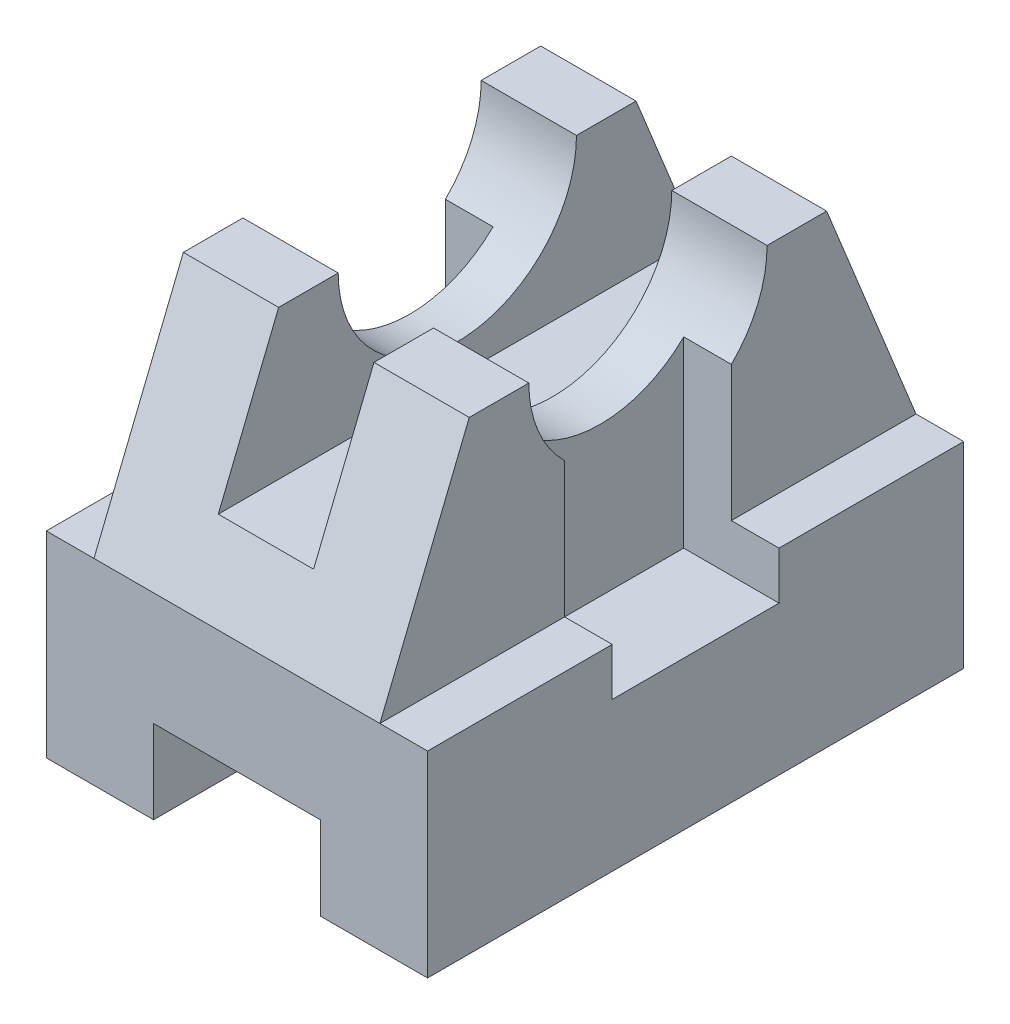
ISO-10303-21;
HEADER;
FILE_DESCRIPTION(('STEP AP214'),'2;1');
FILE_NAME('part.step','',(''),(''),'','','');
FILE_SCHEMA(('AUTOMOTIVE_DESIGN { 1 0 10303 214 1 1 1 1 }'));
ENDSEC;
DATA;
#1=APPLICATION_CONTEXT('core data for automotive mechanical design processes');
#2=APPLICATION_PROTOCOL_DEFINITION('international standard','automotive_design',2000,#1);
#3=PRODUCT_CONTEXT('',#1,'mechanical');
#4=PRODUCT('Part','Part','',(#3));
#5=PRODUCT_RELATED_PRODUCT_CATEGORY('part','',(#4));
#6=PRODUCT_DEFINITION_FORMATION('','',#4);
#7=PRODUCT_DEFINITION_CONTEXT('part definition',#1,'design');
#8=PRODUCT_DEFINITION('design','',#6,#7);
#9=PRODUCT_DEFINITION_SHAPE('','',#8);
#10=(LENGTH_UNIT() NAMED_UNIT(*) SI_UNIT(.MILLI.,.METRE.));
#11=(NAMED_UNIT(*) PLANE_ANGLE_UNIT() SI_UNIT($,.RADIAN.));
#12=(NAMED_UNIT(*) SI_UNIT($,.STERADIAN.) SOLID_ANGLE_UNIT());
#13=UNCERTAINTY_MEASURE_WITH_UNIT(LENGTH_MEASURE(1.E-05),#10,'distance_accuracy_value','');
#14=(GEOMETRIC_REPRESENTATION_CONTEXT(3) GLOBAL_UNCERTAINTY_ASSIGNED_CONTEXT((#13)) GLOBAL_UNIT_ASSIGNED_CONTEXT((#10,
#11,#12)) REPRESENTATION_CONTEXT('',''));
#15=CARTESIAN_POINT('',(0.,0.,0.));
#16=DIRECTION('',(0.,0.,1.));
#17=DIRECTION('',(1.,0.,0.));
#18=AXIS2_PLACEMENT_3D('',#15,#16,#17);
#19=CARTESIAN_POINT('',(0.,0.,0.));
#20=DIRECTION('',(0.,1.,0.));
#21=DIRECTION('',(0.,0.,1.));
#22=AXIS2_PLACEMENT_3D('',#19,#20,#21);
#23=PLANE('',#22);
#24=DIRECTION('',(-1.,0.,0.));
#25=VECTOR('',#24,1.);
#26=CARTESIAN_POINT('',(-32.,0.,-45.));
#27=LINE('',#26,#25);
#28=CARTESIAN_POINT('',(-14.,0.,-45.));
#29=VERTEX_POINT('',#28);
#30=CARTESIAN_POINT('',(-32.,0.,-45.));
#31=VERTEX_POINT('',#30);
#32=EDGE_CURVE('E263',#29,#31,#27,.T.);
#33=ORIENTED_EDGE('',*,*,#32,.F.);
#34=DIRECTION('',(0.,0.,1.));
#35=VECTOR('',#34,1.);
#36=CARTESIAN_POINT('',(-14.,0.,-45.));
#37=LINE('',#36,#35);
#38=CARTESIAN_POINT('',(-14.,0.,45.));
#39=VERTEX_POINT('',#38);
#40=EDGE_CURVE('E246',#29,#39,#37,.T.);
#41=ORIENTED_EDGE('',*,*,#40,.T.);
#42=DIRECTION('',(1.,0.,0.));
#43=VECTOR('',#42,1.);
#44=CARTESIAN_POINT('',(-32.,0.,45.));
#45=LINE('',#44,#43);
#46=CARTESIAN_POINT('',(-32.,0.,45.));
#47=VERTEX_POINT('',#46);
#48=EDGE_CURVE('E281',#47,#39,#45,.T.);
#49=ORIENTED_EDGE('',*,*,#48,.F.);
#50=DIRECTION('',(0.,0.,1.));
#51=VECTOR('',#50,1.);
#52=CARTESIAN_POINT('',(-32.,0.,-45.));
#53=LINE('',#52,#51);
#54=EDGE_CURVE('E269',#31,#47,#53,.T.);
#55=ORIENTED_EDGE('',*,*,#54,.F.);
#56=EDGE_LOOP('',(#33,#41,#49,#55));
#57=FACE_BOUND('',#56,.T.);
#58=ADVANCED_FACE('F37',(#57),#23,.F.);
#59=CARTESIAN_POINT('',(0.,33.,0.));
#60=DIRECTION('',(0.,1.,0.));
#61=DIRECTION('',(0.,0.,1.));
#62=AXIS2_PLACEMENT_3D('',#59,#60,#61);
#63=PLANE('',#62);
#64=DIRECTION('',(-1.,0.,0.));
#65=VECTOR('',#64,1.);
#66=CARTESIAN_POINT('',(0.,33.,-14.));
#67=LINE('',#66,#65);
#68=CARTESIAN_POINT('',(-24.,33.,-14.));
#69=VERTEX_POINT('',#68);
#70=CARTESIAN_POINT('',(-32.,33.,-14.));
#71=VERTEX_POINT('',#70);
#72=EDGE_CURVE('E350',#69,#71,#67,.T.);
#73=ORIENTED_EDGE('',*,*,#72,.F.);
#74=DIRECTION('',(0.,0.,-1.));
#75=VECTOR('',#74,1.);
#76=CARTESIAN_POINT('',(-24.,33.,-45.));
#77=LINE('',#76,#75);
#78=CARTESIAN_POINT('',(-24.,33.,-45.));
#79=VERTEX_POINT('',#78);
#80=EDGE_CURVE('E421',#69,#79,#77,.T.);
#81=ORIENTED_EDGE('',*,*,#80,.T.);
#82=DIRECTION('',(-1.,0.,0.));
#83=VECTOR('',#82,1.);
#84=CARTESIAN_POINT('',(-32.,33.,-45.));
#85=LINE('',#84,#83);
#86=CARTESIAN_POINT('',(-32.,33.,-45.));
#87=VERTEX_POINT('',#86);
#88=EDGE_CURVE('E446',#79,#87,#85,.T.);
#89=ORIENTED_EDGE('',*,*,#88,.T.);
#90=DIRECTION('',(0.,0.,1.));
#91=VECTOR('',#90,1.);
#92=CARTESIAN_POINT('',(-32.,33.,-45.));
#93=LINE('',#92,#91);
#94=EDGE_CURVE('E451',#87,#71,#93,.T.);
#95=ORIENTED_EDGE('',*,*,#94,.T.);
#96=EDGE_LOOP('',(#73,#81,#89,#95));
#97=FACE_BOUND('',#96,.T.);
#98=ADVANCED_FACE('F573',(#97),#63,.T.);
#99=DIRECTION('',(1.,0.,0.));
#100=VECTOR('',#99,1.);
#101=CARTESIAN_POINT('',(0.,33.,14.));
#102=LINE('',#101,#100);
#103=CARTESIAN_POINT('',(24.,33.,14.));
#104=VERTEX_POINT('',#103);
#105=CARTESIAN_POINT('',(32.,33.,14.));
#106=VERTEX_POINT('',#105);
#107=EDGE_CURVE('E356',#104,#106,#102,.T.);
#108=ORIENTED_EDGE('',*,*,#107,.F.);
#109=DIRECTION('',(0.,0.,-1.));
#110=VECTOR('',#109,1.);
#111=CARTESIAN_POINT('',(24.,33.,-45.));
#112=LINE('',#111,#110);
#113=CARTESIAN_POINT('',(24.,33.,45.));
#114=VERTEX_POINT('',#113);
#115=EDGE_CURVE('E403',#114,#104,#112,.T.);
#116=ORIENTED_EDGE('',*,*,#115,.F.);
#117=DIRECTION('',(1.,0.,0.));
#118=VECTOR('',#117,1.);
#119=CARTESIAN_POINT('',(-32.,33.,45.));
#120=LINE('',#119,#118);
#121=CARTESIAN_POINT('',(32.,33.,45.));
#122=VERTEX_POINT('',#121);
#123=EDGE_CURVE('E453',#114,#122,#120,.T.);
#124=ORIENTED_EDGE('',*,*,#123,.T.);
#125=DIRECTION('',(0.,0.,-1.));
#126=VECTOR('',#125,1.);
#127=CARTESIAN_POINT('',(32.,33.,-45.));
#128=LINE('',#127,#126);
#129=EDGE_CURVE('E443',#122,#106,#128,.T.);
#130=ORIENTED_EDGE('',*,*,#129,.T.);
#131=EDGE_LOOP('',(#108,#116,#124,#130));
#132=FACE_BOUND('',#131,.T.);
#133=ADVANCED_FACE('F461',(#132),#63,.T.);
#134=CARTESIAN_POINT('',(24.,70.,0.));
#135=DIRECTION('',(1.,0.,0.));
#136=DIRECTION('',(0.,0.,-1.));
#137=AXIS2_PLACEMENT_3D('',#134,#135,#136);
#138=PLANE('',#137);
#139=DIRECTION('',(0.,-1.,0.));
#140=VECTOR('',#139,1.);
#141=CARTESIAN_POINT('',(24.,70.,14.));
#142=LINE('',#141,#140);
#143=CARTESIAN_POINT('',(24.,55.7171431429143,14.));
#144=VERTEX_POINT('',#143);
#145=EDGE_CURVE('E312',#144,#104,#142,.T.);
#146=ORIENTED_EDGE('',*,*,#145,.F.);
#147=CARTESIAN_POINT('',(24.,70.,0.));
#148=DIRECTION('',(-1.,0.,0.));
#149=DIRECTION('',(0.,0.,-1.));
#150=AXIS2_PLACEMENT_3D('',#147,#148,#149);
#151=CIRCLE('',#150,20.);
#152=CARTESIAN_POINT('',(24.,70.,20.));
#153=VERTEX_POINT('',#152);
#154=EDGE_CURVE('E393',#144,#153,#151,.T.);
#155=ORIENTED_EDGE('',*,*,#154,.T.);
#156=DIRECTION('',(0.,0.,1.));
#157=VECTOR('',#156,1.);
#158=CARTESIAN_POINT('',(24.,70.,30.));
#159=LINE('',#158,#157);
#160=CARTESIAN_POINT('',(24.,70.,30.));
#161=VERTEX_POINT('',#160);
#162=EDGE_CURVE('E397',#153,#161,#159,.T.);
#163=ORIENTED_EDGE('',*,*,#162,.T.);
#164=DIRECTION('',(0.,-0.926739268223405,0.375705108739218));
#165=VECTOR('',#164,1.);
#166=CARTESIAN_POINT('',(24.,33.,45.));
#167=LINE('',#166,#165);
#168=EDGE_CURVE('E399',#161,#114,#167,.T.);
#169=ORIENTED_EDGE('',*,*,#168,.T.);
#170=ORIENTED_EDGE('',*,*,#115,.T.);
#171=EDGE_LOOP('',(#146,#155,#163,#169,#170));
#172=FACE_BOUND('',#171,.T.);
#173=ADVANCED_FACE('F619',(#172),#138,.T.);
#174=CARTESIAN_POINT('',(-24.,70.,0.));
#175=DIRECTION('',(1.,0.,0.));
#176=DIRECTION('',(0.,0.,-1.));
#177=AXIS2_PLACEMENT_3D('',#174,#175,#176);
#178=PLANE('',#177);
#179=ORIENTED_EDGE('',*,*,#80,.F.);
#180=DIRECTION('',(0.,1.,0.));
#181=VECTOR('',#180,1.);
#182=CARTESIAN_POINT('',(-24.,70.,-14.));
#183=LINE('',#182,#181);
#184=CARTESIAN_POINT('',(-24.,55.7171431429143,-14.));
#185=VERTEX_POINT('',#184);
#186=EDGE_CURVE('E307',#69,#185,#183,.T.);
#187=ORIENTED_EDGE('',*,*,#186,.T.);
#188=CARTESIAN_POINT('',(-24.,70.,0.));
#189=DIRECTION('',(-1.,0.,0.));
#190=DIRECTION('',(0.,0.,-1.));
#191=AXIS2_PLACEMENT_3D('',#188,#189,#190);
#192=CIRCLE('',#191,20.);
#193=CARTESIAN_POINT('',(-24.,70.,-20.));
#194=VERTEX_POINT('',#193);
#195=EDGE_CURVE('E413',#194,#185,#192,.T.);
#196=ORIENTED_EDGE('',*,*,#195,.F.);
#197=DIRECTION('',(0.,0.,1.));
#198=VECTOR('',#197,1.);
#199=CARTESIAN_POINT('',(-24.,70.,-20.));
#200=LINE('',#199,#198);
#201=CARTESIAN_POINT('',(-24.,70.,-30.));
#202=VERTEX_POINT('',#201);
#203=EDGE_CURVE('E409',#202,#194,#200,.T.);
#204=ORIENTED_EDGE('',*,*,#203,.F.);
#205=DIRECTION('',(0.,0.926739268223405,0.375705108739218));
#206=VECTOR('',#205,1.);
#207=CARTESIAN_POINT('',(-24.,70.,-30.));
#208=LINE('',#207,#206);
#209=EDGE_CURVE('E386',#79,#202,#208,.T.);
#210=ORIENTED_EDGE('',*,*,#209,.F.);
#211=EDGE_LOOP('',(#179,#187,#196,#204,#210));
#212=FACE_BOUND('',#211,.T.);
#213=ADVANCED_FACE('F555',(#212),#178,.F.);
#214=CARTESIAN_POINT('',(24.,70.,-20.));
#215=DIRECTION('',(0.,-1.,0.));
#216=DIRECTION('',(0.,0.,-1.));
#217=AXIS2_PLACEMENT_3D('',#214,#215,#216);
#218=PLANE('',#217);
#219=DIRECTION('',(-1.,0.,0.));
#220=VECTOR('',#219,1.);
#221=CARTESIAN_POINT('',(24.,70.,-30.));
#222=LINE('',#221,#220);
#223=CARTESIAN_POINT('',(24.,70.,-30.));
#224=VERTEX_POINT('',#223);
#225=CARTESIAN_POINT('',(7.99999999999999,70.,-30.));
#226=VERTEX_POINT('',#225);
#227=EDGE_CURVE('E275',#224,#226,#222,.T.);
#228=ORIENTED_EDGE('',*,*,#227,.T.);
#229=DIRECTION('',(0.,0.,-1.));
#230=VECTOR('',#229,1.);
#231=CARTESIAN_POINT('',(7.99999999999999,70.,-46.2601882858404));
#232=LINE('',#231,#230);
#233=CARTESIAN_POINT('',(8.,70.,-20.));
#234=VERTEX_POINT('',#233);
#235=EDGE_CURVE('E361',#234,#226,#232,.T.);
#236=ORIENTED_EDGE('',*,*,#235,.F.);
#237=DIRECTION('',(-1.,0.,0.));
#238=VECTOR('',#237,1.);
#239=CARTESIAN_POINT('',(24.,70.,-20.));
#240=LINE('',#239,#238);
#241=CARTESIAN_POINT('',(24.,70.,-20.));
#242=VERTEX_POINT('',#241);
#243=EDGE_CURVE('E437',#242,#234,#240,.T.);
#244=ORIENTED_EDGE('',*,*,#243,.F.);
#245=DIRECTION('',(0.,0.,1.));
#246=VECTOR('',#245,1.);
#247=CARTESIAN_POINT('',(24.,70.,-20.));
#248=LINE('',#247,#246);
#249=EDGE_CURVE('E390',#224,#242,#248,.T.);
#250=ORIENTED_EDGE('',*,*,#249,.F.);
#251=EDGE_LOOP('',(#228,#236,#244,#250));
#252=FACE_BOUND('',#251,.T.);
#253=ADVANCED_FACE('F541',(#252),#218,.F.);
#254=CARTESIAN_POINT('',(24.,70.,0.));
#255=DIRECTION('',(-1.,0.,0.));
#256=DIRECTION('',(0.,0.,1.));
#257=AXIS2_PLACEMENT_3D('',#254,#255,#256);
#258=CYLINDRICAL_SURFACE('',#257,20.);
#259=ORIENTED_EDGE('',*,*,#154,.F.);
#260=DIRECTION('',(-1.,0.,0.));
#261=VECTOR('',#260,1.);
#262=CARTESIAN_POINT('',(24.,55.7171431429143,14.));
#263=LINE('',#262,#261);
#264=CARTESIAN_POINT('',(16.,55.7171431429143,14.));
#265=VERTEX_POINT('',#264);
#266=EDGE_CURVE('E358',#144,#265,#263,.T.);
#267=ORIENTED_EDGE('',*,*,#266,.T.);
#268=CARTESIAN_POINT('',(16.,70.,0.));
#269=DIRECTION('',(-1.,0.,0.));
#270=DIRECTION('',(0.,0.,1.));
#271=AXIS2_PLACEMENT_3D('',#268,#269,#270);
#272=CIRCLE('',#271,20.);
#273=CARTESIAN_POINT('',(16.,55.7171431429143,-14.));
#274=VERTEX_POINT('',#273);
#275=EDGE_CURVE('E11',#265,#274,#272,.F.);
#276=ORIENTED_EDGE('',*,*,#275,.T.);
#277=DIRECTION('',(-1.,0.,0.));
#278=VECTOR('',#277,1.);
#279=CARTESIAN_POINT('',(24.,55.7171431429143,-14.));
#280=LINE('',#279,#278);
#281=CARTESIAN_POINT('',(24.,55.7171431429143,-14.));
#282=VERTEX_POINT('',#281);
#283=EDGE_CURVE('E353',#274,#282,#280,.F.);
#284=ORIENTED_EDGE('',*,*,#283,.T.);
#285=EDGE_CURVE('E394',#242,#282,#151,.T.);
#286=ORIENTED_EDGE('',*,*,#285,.F.);
#287=ORIENTED_EDGE('',*,*,#243,.T.);
#288=CARTESIAN_POINT('',(8.,70.,0.));
#289=DIRECTION('',(1.,0.,0.));
#290=DIRECTION('',(0.,0.,-1.));
#291=AXIS2_PLACEMENT_3D('',#288,#289,#290);
#292=CIRCLE('',#291,20.);
#293=CARTESIAN_POINT('',(8.,70.,20.));
#294=VERTEX_POINT('',#293);
#295=EDGE_CURVE('E380',#234,#294,#292,.F.);
#296=ORIENTED_EDGE('',*,*,#295,.T.);
#297=DIRECTION('',(-1.,0.,0.));
#298=VECTOR('',#297,1.);
#299=CARTESIAN_POINT('',(24.,70.,20.));
#300=LINE('',#299,#298);
#301=EDGE_CURVE('E433',#153,#294,#300,.T.);
#302=ORIENTED_EDGE('',*,*,#301,.F.);
#303=EDGE_LOOP('',(#259,#267,#276,#284,#286,#287,#296,#302));
#304=FACE_BOUND('',#303,.T.);
#305=ADVANCED_FACE('F568',(#304),#258,.F.);
#306=CARTESIAN_POINT('',(24.,70.,30.));
#307=DIRECTION('',(0.,-1.,0.));
#308=DIRECTION('',(0.,0.,-1.));
#309=AXIS2_PLACEMENT_3D('',#306,#307,#308);
#310=PLANE('',#309);
#311=ORIENTED_EDGE('',*,*,#301,.T.);
#312=CARTESIAN_POINT('',(8.,70.,30.));
#313=VERTEX_POINT('',#312);
#314=EDGE_CURVE('E370',#313,#294,#232,.T.);
#315=ORIENTED_EDGE('',*,*,#314,.F.);
#316=DIRECTION('',(-1.,0.,0.));
#317=VECTOR('',#316,1.);
#318=CARTESIAN_POINT('',(24.,70.,30.));
#319=LINE('',#318,#317);
#320=EDGE_CURVE('E429',#161,#313,#319,.T.);
#321=ORIENTED_EDGE('',*,*,#320,.F.);
#322=ORIENTED_EDGE('',*,*,#162,.F.);
#323=EDGE_LOOP('',(#311,#315,#321,#322));
#324=FACE_BOUND('',#323,.T.);
#325=ADVANCED_FACE('F668',(#324),#310,.F.);
#326=DIRECTION('',(1.,0.,0.));
#327=VECTOR('',#326,1.);
#328=CARTESIAN_POINT('',(0.,33.,14.));
#329=LINE('',#328,#327);
#330=CARTESIAN_POINT('',(-32.,33.,14.));
#331=VERTEX_POINT('',#330);
#332=CARTESIAN_POINT('',(-24.,33.,14.));
#333=VERTEX_POINT('',#332);
#334=EDGE_CURVE('E346',#331,#333,#329,.T.);
#335=ORIENTED_EDGE('',*,*,#334,.F.);
#336=CARTESIAN_POINT('',(-32.,33.,45.));
#337=VERTEX_POINT('',#336);
#338=EDGE_CURVE('E450',#331,#337,#93,.T.);
#339=ORIENTED_EDGE('',*,*,#338,.T.);
#340=CARTESIAN_POINT('',(-24.,33.,45.));
#341=VERTEX_POINT('',#340);
#342=EDGE_CURVE('E288',#337,#341,#120,.T.);
#343=ORIENTED_EDGE('',*,*,#342,.T.);
#344=EDGE_CURVE('E391',#341,#333,#77,.T.);
#345=ORIENTED_EDGE('',*,*,#344,.T.);
#346=EDGE_LOOP('',(#335,#339,#343,#345));
#347=FACE_BOUND('',#346,.T.);
#348=ADVANCED_FACE('F509',(#347),#63,.T.);
#349=CARTESIAN_POINT('',(32.,33.,-45.));
#350=DIRECTION('',(-1.,0.,0.));
#351=DIRECTION('',(0.,0.,1.));
#352=AXIS2_PLACEMENT_3D('',#349,#350,#351);
#353=PLANE('',#352);
#354=DIRECTION('',(0.,0.,-1.));
#355=VECTOR('',#354,1.);
#356=CARTESIAN_POINT('',(32.,25.,-14.));
#357=LINE('',#356,#355);
#358=CARTESIAN_POINT('',(32.,25.,14.));
#359=VERTEX_POINT('',#358);
#360=CARTESIAN_POINT('',(32.,25.,-14.));
#361=VERTEX_POINT('',#360);
#362=EDGE_CURVE('E338',#359,#361,#357,.T.);
#363=ORIENTED_EDGE('',*,*,#362,.F.);
#364=DIRECTION('',(0.,1.,0.));
#365=VECTOR('',#364,1.);
#366=CARTESIAN_POINT('',(32.,25.,14.));
#367=LINE('',#366,#365);
#368=EDGE_CURVE('E347',#359,#106,#367,.T.);
#369=ORIENTED_EDGE('',*,*,#368,.T.);
#370=ORIENTED_EDGE('',*,*,#129,.F.);
#371=DIRECTION('',(0.,-1.,0.));
#372=VECTOR('',#371,1.);
#373=CARTESIAN_POINT('',(32.,33.,45.));
#374=LINE('',#373,#372);
#375=CARTESIAN_POINT('',(32.,0.,45.));
#376=VERTEX_POINT('',#375);
#377=EDGE_CURVE('E284',#122,#376,#374,.T.);
#378=ORIENTED_EDGE('',*,*,#377,.T.);
#379=DIRECTION('',(0.,0.,-1.));
#380=VECTOR('',#379,1.);
#381=CARTESIAN_POINT('',(32.,0.,-45.));
#382=LINE('',#381,#380);
#383=CARTESIAN_POINT('',(32.,0.,-45.));
#384=VERTEX_POINT('',#383);
#385=EDGE_CURVE('E271',#376,#384,#382,.T.);
#386=ORIENTED_EDGE('',*,*,#385,.T.);
#387=DIRECTION('',(0.,-1.,0.));
#388=VECTOR('',#387,1.);
#389=CARTESIAN_POINT('',(32.,33.,-45.));
#390=LINE('',#389,#388);
#391=CARTESIAN_POINT('',(32.,33.,-45.));
#392=VERTEX_POINT('',#391);
#393=EDGE_CURVE('E293',#392,#384,#390,.T.);
#394=ORIENTED_EDGE('',*,*,#393,.F.);
#395=CARTESIAN_POINT('',(32.,33.,-14.));
#396=VERTEX_POINT('',#395);
#397=EDGE_CURVE('E283',#396,#392,#128,.T.);
#398=ORIENTED_EDGE('',*,*,#397,.F.);
#399=DIRECTION('',(0.,1.,0.));
#400=VECTOR('',#399,1.);
#401=CARTESIAN_POINT('',(32.,25.,-14.));
#402=LINE('',#401,#400);
#403=EDGE_CURVE('E487',#361,#396,#402,.T.);
#404=ORIENTED_EDGE('',*,*,#403,.F.);
#405=EDGE_LOOP('',(#363,#369,#370,#378,#386,#394,#398,#404));
#406=FACE_BOUND('',#405,.T.);
#407=ADVANCED_FACE('F39',(#406),#353,.F.);
#408=CARTESIAN_POINT('',(-32.,33.,-45.));
#409=DIRECTION('',(0.,0.,1.));
#410=DIRECTION('',(1.,0.,0.));
#411=AXIS2_PLACEMENT_3D('',#408,#409,#410);
#412=PLANE('',#411);
#413=DIRECTION('',(-1.,0.,0.));
#414=VECTOR('',#413,1.);
#415=CARTESIAN_POINT('',(-14.,14.,-45.));
#416=LINE('',#415,#414);
#417=CARTESIAN_POINT('',(14.,14.,-45.));
#418=VERTEX_POINT('',#417);
#419=CARTESIAN_POINT('',(-14.,14.,-45.));
#420=VERTEX_POINT('',#419);
#421=EDGE_CURVE('E258',#418,#420,#416,.T.);
#422=ORIENTED_EDGE('',*,*,#421,.T.);
#423=DIRECTION('',(0.,-1.,0.));
#424=VECTOR('',#423,1.);
#425=CARTESIAN_POINT('',(-14.,0.,-45.));
#426=LINE('',#425,#424);
#427=EDGE_CURVE('E249',#420,#29,#426,.T.);
#428=ORIENTED_EDGE('',*,*,#427,.T.);
#429=ORIENTED_EDGE('',*,*,#32,.T.);
#430=DIRECTION('',(0.,-1.,0.));
#431=VECTOR('',#430,1.);
#432=CARTESIAN_POINT('',(-32.,33.,-45.));
#433=LINE('',#432,#431);
#434=EDGE_CURVE('E291',#87,#31,#433,.T.);
#435=ORIENTED_EDGE('',*,*,#434,.F.);
#436=ORIENTED_EDGE('',*,*,#88,.F.);
#437=DIRECTION('',(-1.,0.,0.));
#438=VECTOR('',#437,1.);
#439=CARTESIAN_POINT('',(24.,33.,-45.));
#440=LINE('',#439,#438);
#441=CARTESIAN_POINT('',(24.,33.,-45.));
#442=VERTEX_POINT('',#441);
#443=EDGE_CURVE('E406',#442,#79,#440,.T.);
#444=ORIENTED_EDGE('',*,*,#443,.F.);
#445=EDGE_CURVE('E447',#392,#442,#85,.T.);
#446=ORIENTED_EDGE('',*,*,#445,.F.);
#447=ORIENTED_EDGE('',*,*,#393,.T.);
#448=CARTESIAN_POINT('',(14.,0.,-45.));
#449=VERTEX_POINT('',#448);
#450=EDGE_CURVE('E270',#384,#449,#27,.T.);
#451=ORIENTED_EDGE('',*,*,#450,.T.);
#452=DIRECTION('',(0.,1.,0.));
#453=VECTOR('',#452,1.);
#454=CARTESIAN_POINT('',(14.,0.,-45.));
#455=LINE('',#454,#453);
#456=EDGE_CURVE('E52',#449,#418,#455,.T.);
#457=ORIENTED_EDGE('',*,*,#456,.T.);
#458=EDGE_LOOP('',(#422,#428,#429,#435,#436,#444,#446,#447,#451,#457));
#459=FACE_BOUND('',#458,.T.);
#460=ADVANCED_FACE('F261',(#459),#412,.F.);
#461=CARTESIAN_POINT('',(-32.,33.,-45.));
#462=DIRECTION('',(1.,0.,0.));
#463=DIRECTION('',(0.,0.,-1.));
#464=AXIS2_PLACEMENT_3D('',#461,#462,#463);
#465=PLANE('',#464);
#466=DIRECTION('',(0.,0.,1.));
#467=VECTOR('',#466,1.);
#468=CARTESIAN_POINT('',(-32.,25.,-14.));
#469=LINE('',#468,#467);
#470=CARTESIAN_POINT('',(-32.,25.,-14.));
#471=VERTEX_POINT('',#470);
#472=CARTESIAN_POINT('',(-32.,25.,14.));
#473=VERTEX_POINT('',#472);
#474=EDGE_CURVE('E489',#471,#473,#469,.T.);
#475=ORIENTED_EDGE('',*,*,#474,.F.);
#476=DIRECTION('',(0.,1.,0.));
#477=VECTOR('',#476,1.);
#478=CARTESIAN_POINT('',(-32.,25.,-14.));
#479=LINE('',#478,#477);
#480=EDGE_CURVE('E335',#471,#71,#479,.T.);
#481=ORIENTED_EDGE('',*,*,#480,.T.);
#482=ORIENTED_EDGE('',*,*,#94,.F.);
#483=ORIENTED_EDGE('',*,*,#434,.T.);
#484=ORIENTED_EDGE('',*,*,#54,.T.);
#485=DIRECTION('',(0.,-1.,0.));
#486=VECTOR('',#485,1.);
#487=CARTESIAN_POINT('',(-32.,33.,45.));
#488=LINE('',#487,#486);
#489=EDGE_CURVE('E287',#337,#47,#488,.T.);
#490=ORIENTED_EDGE('',*,*,#489,.F.);
#491=ORIENTED_EDGE('',*,*,#338,.F.);
#492=DIRECTION('',(0.,1.,0.));
#493=VECTOR('',#492,1.);
#494=CARTESIAN_POINT('',(-32.,25.,14.));
#495=LINE('',#494,#493);
#496=EDGE_CURVE('E340',#473,#331,#495,.T.);
#497=ORIENTED_EDGE('',*,*,#496,.F.);
#498=EDGE_LOOP('',(#475,#481,#482,#483,#484,#490,#491,#497));
#499=FACE_BOUND('',#498,.T.);
#500=ADVANCED_FACE('F502',(#499),#465,.F.);
#501=CARTESIAN_POINT('',(-32.,33.,45.));
#502=DIRECTION('',(0.,0.,-1.));
#503=DIRECTION('',(-1.,0.,0.));
#504=AXIS2_PLACEMENT_3D('',#501,#502,#503);
#505=PLANE('',#504);
#506=ORIENTED_EDGE('',*,*,#48,.T.);
#507=DIRECTION('',(0.,-1.,0.));
#508=VECTOR('',#507,1.);
#509=CARTESIAN_POINT('',(-14.,0.,45.));
#510=LINE('',#509,#508);
#511=CARTESIAN_POINT('',(-14.,14.,45.));
#512=VERTEX_POINT('',#511);
#513=EDGE_CURVE('E252',#512,#39,#510,.T.);
#514=ORIENTED_EDGE('',*,*,#513,.F.);
#515=DIRECTION('',(-1.,0.,0.));
#516=VECTOR('',#515,1.);
#517=CARTESIAN_POINT('',(-14.,14.,45.));
#518=LINE('',#517,#516);
#519=CARTESIAN_POINT('',(14.,14.,45.));
#520=VERTEX_POINT('',#519);
#521=EDGE_CURVE('E266',#520,#512,#518,.T.);
#522=ORIENTED_EDGE('',*,*,#521,.F.);
#523=DIRECTION('',(0.,1.,0.));
#524=VECTOR('',#523,1.);
#525=CARTESIAN_POINT('',(14.,0.,45.));
#526=LINE('',#525,#524);
#527=CARTESIAN_POINT('',(14.,0.,45.));
#528=VERTEX_POINT('',#527);
#529=EDGE_CURVE('E594',#528,#520,#526,.T.);
#530=ORIENTED_EDGE('',*,*,#529,.F.);
#531=EDGE_CURVE('E280',#528,#376,#45,.T.);
#532=ORIENTED_EDGE('',*,*,#531,.T.);
#533=ORIENTED_EDGE('',*,*,#377,.F.);
#534=ORIENTED_EDGE('',*,*,#123,.F.);
#535=DIRECTION('',(-1.,0.,0.));
#536=VECTOR('',#535,1.);
#537=CARTESIAN_POINT('',(24.,33.,45.));
#538=LINE('',#537,#536);
#539=EDGE_CURVE('E426',#114,#341,#538,.T.);
#540=ORIENTED_EDGE('',*,*,#539,.T.);
#541=ORIENTED_EDGE('',*,*,#342,.F.);
#542=ORIENTED_EDGE('',*,*,#489,.T.);
#543=EDGE_LOOP('',(#506,#514,#522,#530,#532,#533,#534,#540,#541,#542));
#544=FACE_BOUND('',#543,.T.);
#545=ADVANCED_FACE('F464',(#544),#505,.F.);
#546=DIRECTION('',(-1.,0.,0.));
#547=VECTOR('',#546,1.);
#548=CARTESIAN_POINT('',(0.,33.,-14.));
#549=LINE('',#548,#547);
#550=CARTESIAN_POINT('',(24.,33.,-14.));
#551=VERTEX_POINT('',#550);
#552=EDGE_CURVE('E60',#396,#551,#549,.T.);
#553=ORIENTED_EDGE('',*,*,#552,.F.);
#554=ORIENTED_EDGE('',*,*,#397,.T.);
#555=ORIENTED_EDGE('',*,*,#445,.T.);
#556=EDGE_CURVE('E402',#551,#442,#112,.T.);
#557=ORIENTED_EDGE('',*,*,#556,.F.);
#558=EDGE_LOOP('',(#553,#554,#555,#557));
#559=FACE_BOUND('',#558,.T.);
#560=ADVANCED_FACE('F580',(#559),#63,.T.);
#561=ORIENTED_EDGE('',*,*,#531,.F.);
#562=DIRECTION('',(0.,0.,1.));
#563=VECTOR('',#562,1.);
#564=CARTESIAN_POINT('',(14.,0.,-45.));
#565=LINE('',#564,#563);
#566=EDGE_CURVE('E257',#449,#528,#565,.T.);
#567=ORIENTED_EDGE('',*,*,#566,.F.);
#568=ORIENTED_EDGE('',*,*,#450,.F.);
#569=ORIENTED_EDGE('',*,*,#385,.F.);
#570=EDGE_LOOP('',(#561,#567,#568,#569));
#571=FACE_BOUND('',#570,.T.);
#572=ADVANCED_FACE('F569',(#571),#23,.F.);
#573=CARTESIAN_POINT('',(24.,70.,-30.));
#574=DIRECTION('',(0.,-0.375705108739218,0.926739268223405));
#575=DIRECTION('',(0.,-0.926739268223405,-0.375705108739218));
#576=AXIS2_PLACEMENT_3D('',#573,#574,#575);
#577=PLANE('',#576);
#578=DIRECTION('',(-1.,0.,0.));
#579=VECTOR('',#578,1.);
#580=CARTESIAN_POINT('',(24.,45.,-40.1351351351351));
#581=LINE('',#580,#579);
#582=CARTESIAN_POINT('',(7.99999999999999,45.,-40.1351351351351));
#583=VERTEX_POINT('',#582);
#584=CARTESIAN_POINT('',(-8.00000000000001,45.,-40.1351351351351));
#585=VERTEX_POINT('',#584);
#586=EDGE_CURVE('E368',#583,#585,#581,.T.);
#587=ORIENTED_EDGE('',*,*,#586,.F.);
#588=DIRECTION('',(0.,0.926739268223405,0.375705108739218));
#589=VECTOR('',#588,1.);
#590=CARTESIAN_POINT('',(8.,70.,-30.));
#591=LINE('',#590,#589);
#592=EDGE_CURVE('E383',#583,#226,#591,.T.);
#593=ORIENTED_EDGE('',*,*,#592,.T.);
#594=ORIENTED_EDGE('',*,*,#227,.F.);
#595=DIRECTION('',(0.,0.926739268223405,0.375705108739218));
#596=VECTOR('',#595,1.);
#597=CARTESIAN_POINT('',(24.,70.,-30.));
#598=LINE('',#597,#596);
#599=EDGE_CURVE('E387',#442,#224,#598,.T.);
#600=ORIENTED_EDGE('',*,*,#599,.F.);
#601=ORIENTED_EDGE('',*,*,#443,.T.);
#602=ORIENTED_EDGE('',*,*,#209,.T.);
#603=CARTESIAN_POINT('',(-8.00000000000001,70.,-30.));
#604=VERTEX_POINT('',#603);
#605=EDGE_CURVE('E440',#604,#202,#222,.T.);
#606=ORIENTED_EDGE('',*,*,#605,.F.);
#607=DIRECTION('',(0.,-0.926739268223405,-0.375705108739218));
#608=VECTOR('',#607,1.);
#609=CARTESIAN_POINT('',(-8.00000000000001,70.,-30.));
#610=LINE('',#609,#608);
#611=EDGE_CURVE('E377',#604,#585,#610,.T.);
#612=ORIENTED_EDGE('',*,*,#611,.T.);
#613=EDGE_LOOP('',(#587,#593,#594,#600,#601,#602,#606,#612));
#614=FACE_BOUND('',#613,.T.);
#615=ADVANCED_FACE('F538',(#614),#577,.F.);
#616=CARTESIAN_POINT('',(-8.,70.,-20.));
#617=VERTEX_POINT('',#616);
#618=EDGE_CURVE('E436',#617,#194,#240,.T.);
#619=ORIENTED_EDGE('',*,*,#618,.F.);
#620=DIRECTION('',(0.,0.,1.));
#621=VECTOR('',#620,1.);
#622=CARTESIAN_POINT('',(-8.00000000000001,70.,-46.2601882858404));
#623=LINE('',#622,#621);
#624=EDGE_CURVE('E366',#604,#617,#623,.T.);
#625=ORIENTED_EDGE('',*,*,#624,.F.);
#626=ORIENTED_EDGE('',*,*,#605,.T.);
#627=ORIENTED_EDGE('',*,*,#203,.T.);
#628=EDGE_LOOP('',(#619,#625,#626,#627));
#629=FACE_BOUND('',#628,.T.);
#630=ADVANCED_FACE('F559',(#629),#218,.F.);
#631=ORIENTED_EDGE('',*,*,#195,.T.);
#632=DIRECTION('',(-1.,0.,0.));
#633=VECTOR('',#632,1.);
#634=CARTESIAN_POINT('',(24.,55.7171431429143,-14.));
#635=LINE('',#634,#633);
#636=CARTESIAN_POINT('',(-16.,55.7171431429143,-14.));
#637=VERTEX_POINT('',#636);
#638=EDGE_CURVE('E321',#185,#637,#635,.F.);
#639=ORIENTED_EDGE('',*,*,#638,.T.);
#640=CARTESIAN_POINT('',(-16.,70.,0.));
#641=DIRECTION('',(1.,0.,0.));
#642=DIRECTION('',(0.,0.,-1.));
#643=AXIS2_PLACEMENT_3D('',#640,#641,#642);
#644=CIRCLE('',#643,20.);
#645=CARTESIAN_POINT('',(-16.,55.7171431429143,14.));
#646=VERTEX_POINT('',#645);
#647=EDGE_CURVE('E45',#637,#646,#644,.F.);
#648=ORIENTED_EDGE('',*,*,#647,.T.);
#649=DIRECTION('',(-1.,0.,0.));
#650=VECTOR('',#649,1.);
#651=CARTESIAN_POINT('',(24.,55.7171431429143,14.));
#652=LINE('',#651,#650);
#653=CARTESIAN_POINT('',(-24.,55.7171431429143,14.));
#654=VERTEX_POINT('',#653);
#655=EDGE_CURVE('E319',#646,#654,#652,.T.);
#656=ORIENTED_EDGE('',*,*,#655,.T.);
#657=CARTESIAN_POINT('',(-24.,70.,20.));
#658=VERTEX_POINT('',#657);
#659=EDGE_CURVE('E412',#654,#658,#192,.T.);
#660=ORIENTED_EDGE('',*,*,#659,.T.);
#661=CARTESIAN_POINT('',(-8.,70.,20.));
#662=VERTEX_POINT('',#661);
#663=EDGE_CURVE('E432',#662,#658,#300,.T.);
#664=ORIENTED_EDGE('',*,*,#663,.F.);
#665=CARTESIAN_POINT('',(-8.,70.,0.));
#666=DIRECTION('',(-1.,0.,0.));
#667=DIRECTION('',(0.,0.,1.));
#668=AXIS2_PLACEMENT_3D('',#665,#666,#667);
#669=CIRCLE('',#668,20.);
#670=EDGE_CURVE('E374',#662,#617,#669,.F.);
#671=ORIENTED_EDGE('',*,*,#670,.T.);
#672=ORIENTED_EDGE('',*,*,#618,.T.);
#673=EDGE_LOOP('',(#631,#639,#648,#656,#660,#664,#671,#672));
#674=FACE_BOUND('',#673,.T.);
#675=ADVANCED_FACE('F318',(#674),#258,.F.);
#676=CARTESIAN_POINT('',(-8.,70.,30.));
#677=VERTEX_POINT('',#676);
#678=CARTESIAN_POINT('',(-24.,70.,30.));
#679=VERTEX_POINT('',#678);
#680=EDGE_CURVE('E428',#677,#679,#319,.T.);
#681=ORIENTED_EDGE('',*,*,#680,.F.);
#682=EDGE_CURVE('E371',#662,#677,#623,.T.);
#683=ORIENTED_EDGE('',*,*,#682,.F.);
#684=ORIENTED_EDGE('',*,*,#663,.T.);
#685=DIRECTION('',(0.,0.,1.));
#686=VECTOR('',#685,1.);
#687=CARTESIAN_POINT('',(-24.,70.,30.));
#688=LINE('',#687,#686);
#689=EDGE_CURVE('E415',#658,#679,#688,.T.);
#690=ORIENTED_EDGE('',*,*,#689,.T.);
#691=EDGE_LOOP('',(#681,#683,#684,#690));
#692=FACE_BOUND('',#691,.T.);
#693=ADVANCED_FACE('F520',(#692),#310,.F.);
#694=CARTESIAN_POINT('',(24.,33.,45.));
#695=DIRECTION('',(0.,-0.375705108739218,-0.926739268223405));
#696=DIRECTION('',(0.,0.926739268223405,-0.375705108739218));
#697=AXIS2_PLACEMENT_3D('',#694,#695,#696);
#698=PLANE('',#697);
#699=ORIENTED_EDGE('',*,*,#320,.T.);
#700=DIRECTION('',(0.,-0.926739268223405,0.375705108739218));
#701=VECTOR('',#700,1.);
#702=CARTESIAN_POINT('',(8.,33.,45.));
#703=LINE('',#702,#701);
#704=CARTESIAN_POINT('',(8.,45.,40.1351351351351));
#705=VERTEX_POINT('',#704);
#706=EDGE_CURVE('E301',#313,#705,#703,.T.);
#707=ORIENTED_EDGE('',*,*,#706,.T.);
#708=DIRECTION('',(1.,0.,0.));
#709=VECTOR('',#708,1.);
#710=CARTESIAN_POINT('',(24.,45.,40.1351351351351));
#711=LINE('',#710,#709);
#712=CARTESIAN_POINT('',(-8.00000000000001,45.,40.1351351351351));
#713=VERTEX_POINT('',#712);
#714=EDGE_CURVE('E296',#713,#705,#711,.T.);
#715=ORIENTED_EDGE('',*,*,#714,.F.);
#716=DIRECTION('',(0.,0.926739268223405,-0.375705108739218));
#717=VECTOR('',#716,1.);
#718=CARTESIAN_POINT('',(-7.99999999999999,33.,45.));
#719=LINE('',#718,#717);
#720=EDGE_CURVE('E298',#713,#677,#719,.T.);
#721=ORIENTED_EDGE('',*,*,#720,.T.);
#722=ORIENTED_EDGE('',*,*,#680,.T.);
#723=DIRECTION('',(0.,-0.926739268223405,0.375705108739218));
#724=VECTOR('',#723,1.);
#725=CARTESIAN_POINT('',(-24.,33.,45.));
#726=LINE('',#725,#724);
#727=EDGE_CURVE('E418',#679,#341,#726,.T.);
#728=ORIENTED_EDGE('',*,*,#727,.T.);
#729=ORIENTED_EDGE('',*,*,#539,.F.);
#730=ORIENTED_EDGE('',*,*,#168,.F.);
#731=EDGE_LOOP('',(#699,#707,#715,#721,#722,#728,#729,#730));
#732=FACE_BOUND('',#731,.T.);
#733=ADVANCED_FACE('F527',(#732),#698,.F.);
#734=DIRECTION('',(0.,1.,0.));
#735=VECTOR('',#734,1.);
#736=CARTESIAN_POINT('',(24.,70.,-14.));
#737=LINE('',#736,#735);
#738=EDGE_CURVE('E310',#551,#282,#737,.T.);
#739=ORIENTED_EDGE('',*,*,#738,.F.);
#740=ORIENTED_EDGE('',*,*,#556,.T.);
#741=ORIENTED_EDGE('',*,*,#599,.T.);
#742=ORIENTED_EDGE('',*,*,#249,.T.);
#743=ORIENTED_EDGE('',*,*,#285,.T.);
#744=EDGE_LOOP('',(#739,#740,#741,#742,#743));
#745=FACE_BOUND('',#744,.T.);
#746=ADVANCED_FACE('F545',(#745),#138,.T.);
#747=ORIENTED_EDGE('',*,*,#659,.F.);
#748=DIRECTION('',(0.,-1.,0.));
#749=VECTOR('',#748,1.);
#750=CARTESIAN_POINT('',(-24.,70.,14.));
#751=LINE('',#750,#749);
#752=EDGE_CURVE('E304',#654,#333,#751,.T.);
#753=ORIENTED_EDGE('',*,*,#752,.T.);
#754=ORIENTED_EDGE('',*,*,#344,.F.);
#755=ORIENTED_EDGE('',*,*,#727,.F.);
#756=ORIENTED_EDGE('',*,*,#689,.F.);
#757=EDGE_LOOP('',(#747,#753,#754,#755,#756));
#758=FACE_BOUND('',#757,.T.);
#759=ADVANCED_FACE('F513',(#758),#178,.F.);
#760=CARTESIAN_POINT('',(7.99999999999999,45.,-46.2601882858404));
#761=DIRECTION('',(1.,0.,0.));
#762=DIRECTION('',(0.,0.,-1.));
#763=AXIS2_PLACEMENT_3D('',#760,#761,#762);
#764=PLANE('',#763);
#765=DIRECTION('',(0.,0.,-1.));
#766=VECTOR('',#765,1.);
#767=CARTESIAN_POINT('',(7.99999999999999,45.,-46.2601882858404));
#768=LINE('',#767,#766);
#769=EDGE_CURVE('E362',#705,#583,#768,.T.);
#770=ORIENTED_EDGE('',*,*,#769,.F.);
#771=ORIENTED_EDGE('',*,*,#706,.F.);
#772=ORIENTED_EDGE('',*,*,#314,.T.);
#773=ORIENTED_EDGE('',*,*,#295,.F.);
#774=ORIENTED_EDGE('',*,*,#235,.T.);
#775=ORIENTED_EDGE('',*,*,#592,.F.);
#776=EDGE_LOOP('',(#770,#771,#772,#773,#774,#775));
#777=FACE_BOUND('',#776,.T.);
#778=ADVANCED_FACE('F533',(#777),#764,.F.);
#779=CARTESIAN_POINT('',(-8.00000000000001,45.,-46.2601882858404));
#780=DIRECTION('',(-1.,0.,0.));
#781=DIRECTION('',(0.,0.,1.));
#782=AXIS2_PLACEMENT_3D('',#779,#780,#781);
#783=PLANE('',#782);
#784=ORIENTED_EDGE('',*,*,#624,.T.);
#785=ORIENTED_EDGE('',*,*,#670,.F.);
#786=ORIENTED_EDGE('',*,*,#682,.T.);
#787=ORIENTED_EDGE('',*,*,#720,.F.);
#788=DIRECTION('',(0.,0.,1.));
#789=VECTOR('',#788,1.);
#790=CARTESIAN_POINT('',(-8.00000000000001,45.,-46.2601882858404));
#791=LINE('',#790,#789);
#792=EDGE_CURVE('E365',#585,#713,#791,.T.);
#793=ORIENTED_EDGE('',*,*,#792,.F.);
#794=ORIENTED_EDGE('',*,*,#611,.F.);
#795=EDGE_LOOP('',(#784,#785,#786,#787,#793,#794));
#796=FACE_BOUND('',#795,.T.);
#797=ADVANCED_FACE('F523',(#796),#783,.F.);
#798=CARTESIAN_POINT('',(0.,45.,0.));
#799=DIRECTION('',(0.,1.,0.));
#800=DIRECTION('',(0.,0.,1.));
#801=AXIS2_PLACEMENT_3D('',#798,#799,#800);
#802=PLANE('',#801);
#803=ORIENTED_EDGE('',*,*,#586,.T.);
#804=ORIENTED_EDGE('',*,*,#792,.T.);
#805=ORIENTED_EDGE('',*,*,#714,.T.);
#806=ORIENTED_EDGE('',*,*,#769,.T.);
#807=EDGE_LOOP('',(#803,#804,#805,#806));
#808=FACE_BOUND('',#807,.T.);
#809=ADVANCED_FACE('F530',(#808),#802,.T.);
#810=CARTESIAN_POINT('',(-16.,25.,-14.));
#811=DIRECTION('',(1.,0.,0.));
#812=DIRECTION('',(0.,0.,-1.));
#813=AXIS2_PLACEMENT_3D('',#810,#811,#812);
#814=PLANE('',#813);
#815=DIRECTION('',(0.,1.,0.));
#816=VECTOR('',#815,1.);
#817=CARTESIAN_POINT('',(-16.,25.,-14.));
#818=LINE('',#817,#816);
#819=CARTESIAN_POINT('',(-16.,25.,-14.));
#820=VERTEX_POINT('',#819);
#821=EDGE_CURVE('E327',#820,#637,#818,.T.);
#822=ORIENTED_EDGE('',*,*,#821,.F.);
#823=DIRECTION('',(0.,0.,-1.));
#824=VECTOR('',#823,1.);
#825=CARTESIAN_POINT('',(-16.,25.,-14.));
#826=LINE('',#825,#824);
#827=CARTESIAN_POINT('',(-16.,25.,14.));
#828=VERTEX_POINT('',#827);
#829=EDGE_CURVE('E496',#828,#820,#826,.T.);
#830=ORIENTED_EDGE('',*,*,#829,.F.);
#831=DIRECTION('',(0.,1.,0.));
#832=VECTOR('',#831,1.);
#833=CARTESIAN_POINT('',(-16.,25.,14.));
#834=LINE('',#833,#832);
#835=EDGE_CURVE('E329',#828,#646,#834,.T.);
#836=ORIENTED_EDGE('',*,*,#835,.T.);
#837=ORIENTED_EDGE('',*,*,#647,.F.);
#838=EDGE_LOOP('',(#822,#830,#836,#837));
#839=FACE_BOUND('',#838,.T.);
#840=ADVANCED_FACE('F325',(#839),#814,.F.);
#841=CARTESIAN_POINT('',(-32.,25.,-14.));
#842=DIRECTION('',(0.,0.,-1.));
#843=DIRECTION('',(-1.,0.,0.));
#844=AXIS2_PLACEMENT_3D('',#841,#842,#843);
#845=PLANE('',#844);
#846=ORIENTED_EDGE('',*,*,#72,.T.);
#847=ORIENTED_EDGE('',*,*,#480,.F.);
#848=DIRECTION('',(-1.,0.,0.));
#849=VECTOR('',#848,1.);
#850=CARTESIAN_POINT('',(-32.,25.,-14.));
#851=LINE('',#850,#849);
#852=EDGE_CURVE('E334',#820,#471,#851,.T.);
#853=ORIENTED_EDGE('',*,*,#852,.F.);
#854=ORIENTED_EDGE('',*,*,#821,.T.);
#855=ORIENTED_EDGE('',*,*,#638,.F.);
#856=ORIENTED_EDGE('',*,*,#186,.F.);
#857=EDGE_LOOP('',(#846,#847,#853,#854,#855,#856));
#858=FACE_BOUND('',#857,.T.);
#859=ADVANCED_FACE('F332',(#858),#845,.F.);
#860=CARTESIAN_POINT('',(-32.,25.,14.));
#861=DIRECTION('',(0.,0.,1.));
#862=DIRECTION('',(1.,0.,0.));
#863=AXIS2_PLACEMENT_3D('',#860,#861,#862);
#864=PLANE('',#863);
#865=ORIENTED_EDGE('',*,*,#334,.T.);
#866=ORIENTED_EDGE('',*,*,#752,.F.);
#867=ORIENTED_EDGE('',*,*,#655,.F.);
#868=ORIENTED_EDGE('',*,*,#835,.F.);
#869=DIRECTION('',(1.,0.,0.));
#870=VECTOR('',#869,1.);
#871=CARTESIAN_POINT('',(-32.,25.,14.));
#872=LINE('',#871,#870);
#873=EDGE_CURVE('E492',#473,#828,#872,.T.);
#874=ORIENTED_EDGE('',*,*,#873,.F.);
#875=ORIENTED_EDGE('',*,*,#496,.T.);
#876=EDGE_LOOP('',(#865,#866,#867,#868,#874,#875));
#877=FACE_BOUND('',#876,.T.);
#878=ADVANCED_FACE('F508',(#877),#864,.F.);
#879=CARTESIAN_POINT('',(0.,25.,0.));
#880=DIRECTION('',(0.,1.,0.));
#881=DIRECTION('',(0.,0.,1.));
#882=AXIS2_PLACEMENT_3D('',#879,#880,#881);
#883=PLANE('',#882);
#884=ORIENTED_EDGE('',*,*,#474,.T.);
#885=ORIENTED_EDGE('',*,*,#873,.T.);
#886=ORIENTED_EDGE('',*,*,#829,.T.);
#887=ORIENTED_EDGE('',*,*,#852,.T.);
#888=EDGE_LOOP('',(#884,#885,#886,#887));
#889=FACE_BOUND('',#888,.T.);
#890=ADVANCED_FACE('F499',(#889),#883,.T.);
#891=CARTESIAN_POINT('',(16.,25.,-14.));
#892=DIRECTION('',(-1.,0.,0.));
#893=DIRECTION('',(0.,0.,1.));
#894=AXIS2_PLACEMENT_3D('',#891,#892,#893);
#895=PLANE('',#894);
#896=DIRECTION('',(0.,1.,0.));
#897=VECTOR('',#896,1.);
#898=CARTESIAN_POINT('',(16.,25.,14.));
#899=LINE('',#898,#897);
#900=CARTESIAN_POINT('',(16.,25.,14.));
#901=VERTEX_POINT('',#900);
#902=EDGE_CURVE('E476',#901,#265,#899,.T.);
#903=ORIENTED_EDGE('',*,*,#902,.F.);
#904=DIRECTION('',(0.,0.,1.));
#905=VECTOR('',#904,1.);
#906=CARTESIAN_POINT('',(16.,25.,-14.));
#907=LINE('',#906,#905);
#908=CARTESIAN_POINT('',(16.,25.,-14.));
#909=VERTEX_POINT('',#908);
#910=EDGE_CURVE('E606',#909,#901,#907,.T.);
#911=ORIENTED_EDGE('',*,*,#910,.F.);
#912=DIRECTION('',(0.,1.,0.));
#913=VECTOR('',#912,1.);
#914=CARTESIAN_POINT('',(16.,25.,-14.));
#915=LINE('',#914,#913);
#916=EDGE_CURVE('E479',#909,#274,#915,.T.);
#917=ORIENTED_EDGE('',*,*,#916,.T.);
#918=ORIENTED_EDGE('',*,*,#275,.F.);
#919=EDGE_LOOP('',(#903,#911,#917,#918));
#920=FACE_BOUND('',#919,.T.);
#921=ADVANCED_FACE('F642',(#920),#895,.F.);
#922=CARTESIAN_POINT('',(32.,25.,14.));
#923=DIRECTION('',(0.,0.,1.));
#924=DIRECTION('',(1.,0.,0.));
#925=AXIS2_PLACEMENT_3D('',#922,#923,#924);
#926=PLANE('',#925);
#927=ORIENTED_EDGE('',*,*,#145,.T.);
#928=ORIENTED_EDGE('',*,*,#107,.T.);
#929=ORIENTED_EDGE('',*,*,#368,.F.);
#930=DIRECTION('',(1.,0.,0.));
#931=VECTOR('',#930,1.);
#932=CARTESIAN_POINT('',(32.,25.,14.));
#933=LINE('',#932,#931);
#934=EDGE_CURVE('E482',#901,#359,#933,.T.);
#935=ORIENTED_EDGE('',*,*,#934,.F.);
#936=ORIENTED_EDGE('',*,*,#902,.T.);
#937=ORIENTED_EDGE('',*,*,#266,.F.);
#938=EDGE_LOOP('',(#927,#928,#929,#935,#936,#937));
#939=FACE_BOUND('',#938,.T.);
#940=ADVANCED_FACE('F611',(#939),#926,.F.);
#941=CARTESIAN_POINT('',(32.,25.,-14.));
#942=DIRECTION('',(0.,0.,-1.));
#943=DIRECTION('',(-1.,0.,0.));
#944=AXIS2_PLACEMENT_3D('',#941,#942,#943);
#945=PLANE('',#944);
#946=ORIENTED_EDGE('',*,*,#916,.F.);
#947=DIRECTION('',(-1.,0.,0.));
#948=VECTOR('',#947,1.);
#949=CARTESIAN_POINT('',(32.,25.,-14.));
#950=LINE('',#949,#948);
#951=EDGE_CURVE('E604',#361,#909,#950,.T.);
#952=ORIENTED_EDGE('',*,*,#951,.F.);
#953=ORIENTED_EDGE('',*,*,#403,.T.);
#954=ORIENTED_EDGE('',*,*,#552,.T.);
#955=ORIENTED_EDGE('',*,*,#738,.T.);
#956=ORIENTED_EDGE('',*,*,#283,.F.);
#957=EDGE_LOOP('',(#946,#952,#953,#954,#955,#956));
#958=FACE_BOUND('',#957,.T.);
#959=ADVANCED_FACE('F639',(#958),#945,.F.);
#960=CARTESIAN_POINT('',(0.,25.,0.));
#961=DIRECTION('',(0.,-1.,0.));
#962=DIRECTION('',(0.,0.,-1.));
#963=AXIS2_PLACEMENT_3D('',#960,#961,#962);
#964=PLANE('',#963);
#965=ORIENTED_EDGE('',*,*,#362,.T.);
#966=ORIENTED_EDGE('',*,*,#951,.T.);
#967=ORIENTED_EDGE('',*,*,#910,.T.);
#968=ORIENTED_EDGE('',*,*,#934,.T.);
#969=EDGE_LOOP('',(#965,#966,#967,#968));
#970=FACE_BOUND('',#969,.T.);
#971=ADVANCED_FACE('F610',(#970),#964,.F.);
#972=CARTESIAN_POINT('',(-14.,0.,-45.));
#973=DIRECTION('',(-1.,0.,0.));
#974=DIRECTION('',(0.,-1.,0.));
#975=AXIS2_PLACEMENT_3D('',#972,#973,#974);
#976=PLANE('',#975);
#977=ORIENTED_EDGE('',*,*,#513,.T.);
#978=ORIENTED_EDGE('',*,*,#40,.F.);
#979=ORIENTED_EDGE('',*,*,#427,.F.);
#980=DIRECTION('',(0.,0.,1.));
#981=VECTOR('',#980,1.);
#982=CARTESIAN_POINT('',(-14.,14.,-45.));
#983=LINE('',#982,#981);
#984=EDGE_CURVE('E493',#420,#512,#983,.T.);
#985=ORIENTED_EDGE('',*,*,#984,.T.);
#986=EDGE_LOOP('',(#977,#978,#979,#985));
#987=FACE_BOUND('',#986,.T.);
#988=ADVANCED_FACE('F248',(#987),#976,.F.);
#989=CARTESIAN_POINT('',(-14.,14.,-45.));
#990=DIRECTION('',(0.,1.,0.));
#991=DIRECTION('',(0.,0.,1.));
#992=AXIS2_PLACEMENT_3D('',#989,#990,#991);
#993=PLANE('',#992);
#994=ORIENTED_EDGE('',*,*,#521,.T.);
#995=ORIENTED_EDGE('',*,*,#984,.F.);
#996=ORIENTED_EDGE('',*,*,#421,.F.);
#997=DIRECTION('',(0.,0.,1.));
#998=VECTOR('',#997,1.);
#999=CARTESIAN_POINT('',(14.,14.,-45.));
#1000=LINE('',#999,#998);
#1001=EDGE_CURVE('E600',#418,#520,#1000,.T.);
#1002=ORIENTED_EDGE('',*,*,#1001,.T.);
#1003=EDGE_LOOP('',(#994,#995,#996,#1002));
#1004=FACE_BOUND('',#1003,.T.);
#1005=ADVANCED_FACE('F626',(#1004),#993,.F.);
#1006=CARTESIAN_POINT('',(14.,0.,-45.));
#1007=DIRECTION('',(1.,0.,0.));
#1008=DIRECTION('',(0.,1.,0.));
#1009=AXIS2_PLACEMENT_3D('',#1006,#1007,#1008);
#1010=PLANE('',#1009);
#1011=ORIENTED_EDGE('',*,*,#529,.T.);
#1012=ORIENTED_EDGE('',*,*,#1001,.F.);
#1013=ORIENTED_EDGE('',*,*,#456,.F.);
#1014=ORIENTED_EDGE('',*,*,#566,.T.);
#1015=EDGE_LOOP('',(#1011,#1012,#1013,#1014));
#1016=FACE_BOUND('',#1015,.T.);
#1017=ADVANCED_FACE('F627',(#1016),#1010,.F.);
#1018=CLOSED_SHELL('',(#58,#98,#133,#173,#213,#253,#305,#325,#348,#407,#460,#500,#545,#560,#572,
#615,#630,#675,#693,#733,#746,#759,#778,#797,#809,#840,#859,#878,#890,#921,#940,#959,#971,#988,
#1005,#1017));
#1019=MANIFOLD_SOLID_BREP('B2',#1018);
#1020=ADVANCED_BREP_SHAPE_REPRESENTATION('',(#18,#1019),#14);
#1021=SHAPE_DEFINITION_REPRESENTATION(#9,#1020);
ENDSEC;
END-ISO-10303-21;
